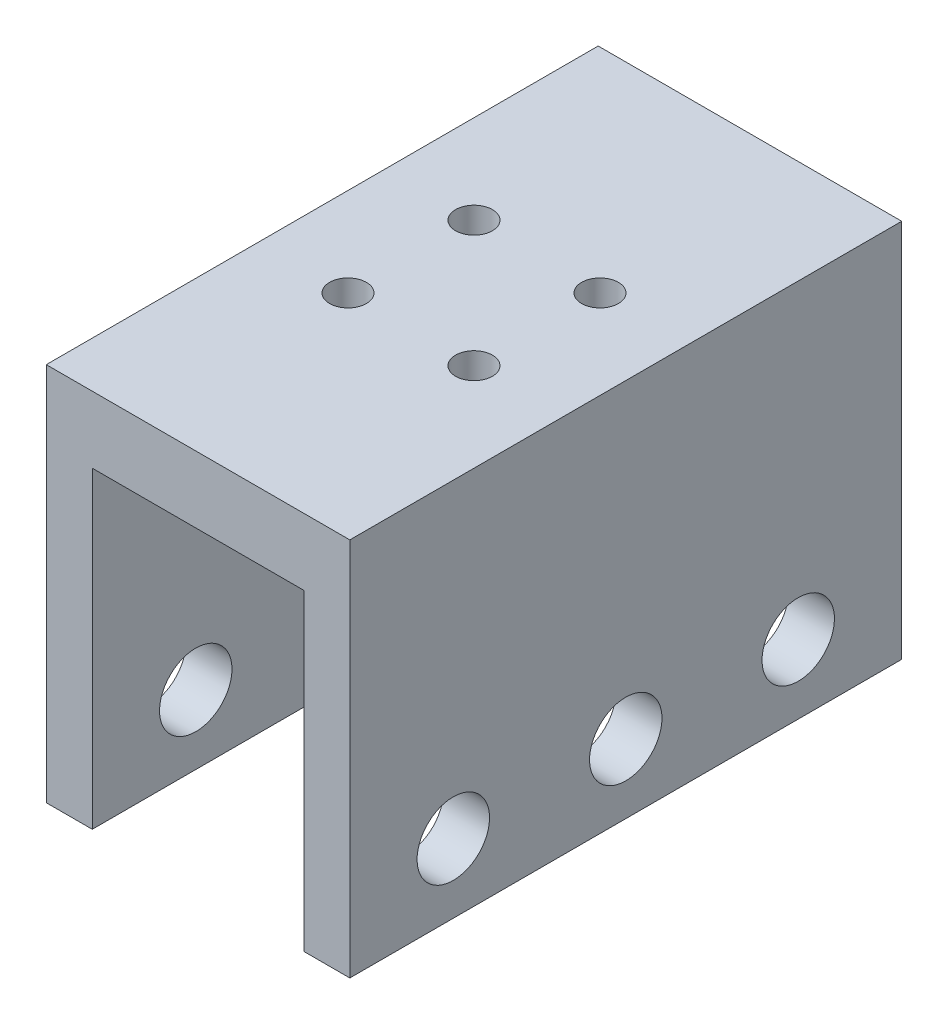
ISO-10303-21;
HEADER;
FILE_DESCRIPTION(('STEP AP214'),'2;1');
FILE_NAME('part.step','',(''),(''),'','','');
FILE_SCHEMA(('AUTOMOTIVE_DESIGN { 1 0 10303 214 1 1 1 1 }'));
ENDSEC;
DATA;
#1=APPLICATION_CONTEXT('core data for automotive mechanical design processes');
#2=APPLICATION_PROTOCOL_DEFINITION('international standard','automotive_design',2000,#1);
#3=PRODUCT_CONTEXT('',#1,'mechanical');
#4=PRODUCT('Part','Part','',(#3));
#5=PRODUCT_RELATED_PRODUCT_CATEGORY('part','',(#4));
#6=PRODUCT_DEFINITION_FORMATION('','',#4);
#7=PRODUCT_DEFINITION_CONTEXT('part definition',#1,'design');
#8=PRODUCT_DEFINITION('design','',#6,#7);
#9=PRODUCT_DEFINITION_SHAPE('','',#8);
#10=(LENGTH_UNIT() NAMED_UNIT(*) SI_UNIT(.MILLI.,.METRE.));
#11=(NAMED_UNIT(*) PLANE_ANGLE_UNIT() SI_UNIT($,.RADIAN.));
#12=(NAMED_UNIT(*) SI_UNIT($,.STERADIAN.) SOLID_ANGLE_UNIT());
#13=UNCERTAINTY_MEASURE_WITH_UNIT(LENGTH_MEASURE(1.E-05),#10,'distance_accuracy_value','');
#14=(GEOMETRIC_REPRESENTATION_CONTEXT(3) GLOBAL_UNCERTAINTY_ASSIGNED_CONTEXT((#13)) GLOBAL_UNIT_ASSIGNED_CONTEXT((#10,
#11,#12)) REPRESENTATION_CONTEXT('',''));
#15=CARTESIAN_POINT('',(0.,0.,0.));
#16=DIRECTION('',(0.,0.,1.));
#17=DIRECTION('',(1.,0.,0.));
#18=AXIS2_PLACEMENT_3D('',#15,#16,#17);
#19=CARTESIAN_POINT('',(4.,0.,24.));
#20=DIRECTION('',(0.,1.,0.));
#21=DIRECTION('',(-1.,0.,0.));
#22=AXIS2_PLACEMENT_3D('',#19,#20,#21);
#23=PLANE('',#22);
#24=DIRECTION('',(1.,0.,0.));
#25=VECTOR('',#24,1.);
#26=CARTESIAN_POINT('',(4.,0.,-24.));
#27=LINE('',#26,#25);
#28=CARTESIAN_POINT('',(0.,0.,-24.));
#29=VERTEX_POINT('',#28);
#30=CARTESIAN_POINT('',(4.,0.,-24.));
#31=VERTEX_POINT('',#30);
#32=EDGE_CURVE('E140',#29,#31,#27,.T.);
#33=ORIENTED_EDGE('',*,*,#32,.T.);
#34=DIRECTION('',(0.,0.,-1.));
#35=VECTOR('',#34,1.);
#36=CARTESIAN_POINT('',(4.,0.,24.));
#37=LINE('',#36,#35);
#38=CARTESIAN_POINT('',(4.,0.,24.));
#39=VERTEX_POINT('',#38);
#40=EDGE_CURVE('E11',#39,#31,#37,.T.);
#41=ORIENTED_EDGE('',*,*,#40,.F.);
#42=DIRECTION('',(1.,0.,0.));
#43=VECTOR('',#42,1.);
#44=CARTESIAN_POINT('',(4.,0.,24.));
#45=LINE('',#44,#43);
#46=CARTESIAN_POINT('',(0.,0.,24.));
#47=VERTEX_POINT('',#46);
#48=EDGE_CURVE('E163',#47,#39,#45,.T.);
#49=ORIENTED_EDGE('',*,*,#48,.F.);
#50=DIRECTION('',(0.,0.,-1.));
#51=VECTOR('',#50,1.);
#52=CARTESIAN_POINT('',(0.,0.,24.));
#53=LINE('',#52,#51);
#54=EDGE_CURVE('E136',#47,#29,#53,.T.);
#55=ORIENTED_EDGE('',*,*,#54,.T.);
#56=EDGE_LOOP('',(#33,#41,#49,#55));
#57=FACE_BOUND('',#56,.T.);
#58=ADVANCED_FACE('F39',(#57),#23,.F.);
#59=CARTESIAN_POINT('',(4.,27.2,24.));
#60=DIRECTION('',(-1.,0.,0.));
#61=DIRECTION('',(0.,-1.,0.));
#62=AXIS2_PLACEMENT_3D('',#59,#60,#61);
#63=PLANE('',#62);
#64=CARTESIAN_POINT('',(4.,6.,15.));
#65=DIRECTION('',(-1.,0.,0.));
#66=DIRECTION('',(0.,-1.,0.));
#67=AXIS2_PLACEMENT_3D('',#64,#65,#66);
#68=CIRCLE('',#67,3.15);
#69=CARTESIAN_POINT('',(4.,2.85,15.));
#70=VERTEX_POINT('',#69);
#71=EDGE_CURVE('E220',#70,#70,#68,.T.);
#72=ORIENTED_EDGE('',*,*,#71,.T.);
#73=EDGE_LOOP('',(#72));
#74=FACE_BOUND('',#73,.T.);
#75=CARTESIAN_POINT('',(4.,6.,-15.));
#76=DIRECTION('',(-1.,0.,0.));
#77=DIRECTION('',(0.,-1.,0.));
#78=AXIS2_PLACEMENT_3D('',#75,#76,#77);
#79=CIRCLE('',#78,3.15);
#80=CARTESIAN_POINT('',(4.,2.85,-15.));
#81=VERTEX_POINT('',#80);
#82=EDGE_CURVE('E246',#81,#81,#79,.T.);
#83=ORIENTED_EDGE('',*,*,#82,.T.);
#84=EDGE_LOOP('',(#83));
#85=FACE_BOUND('',#84,.T.);
#86=CARTESIAN_POINT('',(4.,6.,0.));
#87=DIRECTION('',(-1.,0.,0.));
#88=DIRECTION('',(0.,-1.,0.));
#89=AXIS2_PLACEMENT_3D('',#86,#87,#88);
#90=CIRCLE('',#89,3.15);
#91=CARTESIAN_POINT('',(4.,2.85,0.));
#92=VERTEX_POINT('',#91);
#93=EDGE_CURVE('E254',#92,#92,#90,.T.);
#94=ORIENTED_EDGE('',*,*,#93,.T.);
#95=EDGE_LOOP('',(#94));
#96=FACE_BOUND('',#95,.T.);
#97=DIRECTION('',(0.,1.,0.));
#98=VECTOR('',#97,1.);
#99=CARTESIAN_POINT('',(4.,27.2,-24.));
#100=LINE('',#99,#98);
#101=CARTESIAN_POINT('',(4.,27.2,-24.));
#102=VERTEX_POINT('',#101);
#103=EDGE_CURVE('E144',#31,#102,#100,.T.);
#104=ORIENTED_EDGE('',*,*,#103,.T.);
#105=DIRECTION('',(0.,0.,-1.));
#106=VECTOR('',#105,1.);
#107=CARTESIAN_POINT('',(4.,27.2,24.));
#108=LINE('',#107,#106);
#109=CARTESIAN_POINT('',(4.,27.2,24.));
#110=VERTEX_POINT('',#109);
#111=EDGE_CURVE('E48',#110,#102,#108,.T.);
#112=ORIENTED_EDGE('',*,*,#111,.F.);
#113=DIRECTION('',(0.,1.,0.));
#114=VECTOR('',#113,1.);
#115=CARTESIAN_POINT('',(4.,27.2,24.));
#116=LINE('',#115,#114);
#117=EDGE_CURVE('E99',#39,#110,#116,.T.);
#118=ORIENTED_EDGE('',*,*,#117,.F.);
#119=ORIENTED_EDGE('',*,*,#40,.T.);
#120=EDGE_LOOP('',(#104,#112,#118,#119));
#121=FACE_BOUND('',#120,.T.);
#122=ADVANCED_FACE('F312',(#74,#85,#96,#121),#63,.F.);
#123=CARTESIAN_POINT('',(22.4,27.2,24.));
#124=DIRECTION('',(0.,1.,0.));
#125=DIRECTION('',(-1.,0.,0.));
#126=AXIS2_PLACEMENT_3D('',#123,#124,#125);
#127=PLANE('',#126);
#128=CARTESIAN_POINT('',(7.71992244580426,27.2,-5.48007755419574));
#129=DIRECTION('',(0.,-1.,0.));
#130=DIRECTION('',(1.,0.,0.));
#131=AXIS2_PLACEMENT_3D('',#128,#129,#130);
#132=CIRCLE('',#131,1.6);
#133=CARTESIAN_POINT('',(9.31992244580426,27.2,-5.48007755419574));
#134=VERTEX_POINT('',#133);
#135=EDGE_CURVE('E215',#134,#134,#132,.T.);
#136=ORIENTED_EDGE('',*,*,#135,.F.);
#137=EDGE_LOOP('',(#136));
#138=FACE_BOUND('',#137,.T.);
#139=CARTESIAN_POINT('',(18.6800775541957,27.2,-5.48007755419574));
#140=DIRECTION('',(0.,-1.,0.));
#141=DIRECTION('',(1.,0.,0.));
#142=AXIS2_PLACEMENT_3D('',#139,#140,#141);
#143=CIRCLE('',#142,1.60000000000001);
#144=CARTESIAN_POINT('',(20.2800775541958,27.2,-5.48007755419574));
#145=VERTEX_POINT('',#144);
#146=EDGE_CURVE('E224',#145,#145,#143,.T.);
#147=ORIENTED_EDGE('',*,*,#146,.F.);
#148=EDGE_LOOP('',(#147));
#149=FACE_BOUND('',#148,.T.);
#150=CARTESIAN_POINT('',(18.6800775541957,27.2,5.48007755419574));
#151=DIRECTION('',(0.,-1.,0.));
#152=DIRECTION('',(1.,0.,0.));
#153=AXIS2_PLACEMENT_3D('',#150,#151,#152);
#154=CIRCLE('',#153,1.60000000000001);
#155=CARTESIAN_POINT('',(20.2800775541958,27.2,5.48007755419574));
#156=VERTEX_POINT('',#155);
#157=EDGE_CURVE('E232',#156,#156,#154,.T.);
#158=ORIENTED_EDGE('',*,*,#157,.F.);
#159=EDGE_LOOP('',(#158));
#160=FACE_BOUND('',#159,.T.);
#161=CARTESIAN_POINT('',(7.71992244580426,27.2,5.48007755419574));
#162=DIRECTION('',(0.,-1.,0.));
#163=DIRECTION('',(1.,0.,0.));
#164=AXIS2_PLACEMENT_3D('',#161,#162,#163);
#165=CIRCLE('',#164,1.6);
#166=CARTESIAN_POINT('',(9.31992244580426,27.2,5.48007755419574));
#167=VERTEX_POINT('',#166);
#168=EDGE_CURVE('E207',#167,#167,#165,.T.);
#169=ORIENTED_EDGE('',*,*,#168,.F.);
#170=EDGE_LOOP('',(#169));
#171=FACE_BOUND('',#170,.T.);
#172=DIRECTION('',(1.,0.,0.));
#173=VECTOR('',#172,1.);
#174=CARTESIAN_POINT('',(22.4,27.2,-24.));
#175=LINE('',#174,#173);
#176=CARTESIAN_POINT('',(22.4,27.2,-24.));
#177=VERTEX_POINT('',#176);
#178=EDGE_CURVE('E148',#102,#177,#175,.T.);
#179=ORIENTED_EDGE('',*,*,#178,.T.);
#180=DIRECTION('',(0.,0.,-1.));
#181=VECTOR('',#180,1.);
#182=CARTESIAN_POINT('',(22.4,27.2,24.));
#183=LINE('',#182,#181);
#184=CARTESIAN_POINT('',(22.4,27.2,24.));
#185=VERTEX_POINT('',#184);
#186=EDGE_CURVE('E174',#185,#177,#183,.T.);
#187=ORIENTED_EDGE('',*,*,#186,.F.);
#188=DIRECTION('',(1.,0.,0.));
#189=VECTOR('',#188,1.);
#190=CARTESIAN_POINT('',(22.4,27.2,24.));
#191=LINE('',#190,#189);
#192=EDGE_CURVE('E184',#110,#185,#191,.T.);
#193=ORIENTED_EDGE('',*,*,#192,.F.);
#194=ORIENTED_EDGE('',*,*,#111,.T.);
#195=EDGE_LOOP('',(#179,#187,#193,#194));
#196=FACE_BOUND('',#195,.T.);
#197=ADVANCED_FACE('F182',(#138,#149,#160,#171,#196),#127,.F.);
#198=CARTESIAN_POINT('',(22.4,0.,24.));
#199=DIRECTION('',(1.,0.,0.));
#200=DIRECTION('',(0.,1.,0.));
#201=AXIS2_PLACEMENT_3D('',#198,#199,#200);
#202=PLANE('',#201);
#203=CARTESIAN_POINT('',(22.4,6.,15.));
#204=DIRECTION('',(1.,0.,0.));
#205=DIRECTION('',(0.,1.,0.));
#206=AXIS2_PLACEMENT_3D('',#203,#204,#205);
#207=CIRCLE('',#206,3.15);
#208=CARTESIAN_POINT('',(22.4,9.15,15.));
#209=VERTEX_POINT('',#208);
#210=EDGE_CURVE('E242',#209,#209,#207,.T.);
#211=ORIENTED_EDGE('',*,*,#210,.T.);
#212=EDGE_LOOP('',(#211));
#213=FACE_BOUND('',#212,.T.);
#214=CARTESIAN_POINT('',(22.4,6.,-15.));
#215=DIRECTION('',(1.,0.,0.));
#216=DIRECTION('',(0.,1.,0.));
#217=AXIS2_PLACEMENT_3D('',#214,#215,#216);
#218=CIRCLE('',#217,3.15);
#219=CARTESIAN_POINT('',(22.4,9.15,-15.));
#220=VERTEX_POINT('',#219);
#221=EDGE_CURVE('E250',#220,#220,#218,.T.);
#222=ORIENTED_EDGE('',*,*,#221,.T.);
#223=EDGE_LOOP('',(#222));
#224=FACE_BOUND('',#223,.T.);
#225=CARTESIAN_POINT('',(22.4,6.,0.));
#226=DIRECTION('',(1.,0.,0.));
#227=DIRECTION('',(0.,1.,0.));
#228=AXIS2_PLACEMENT_3D('',#225,#226,#227);
#229=CIRCLE('',#228,3.15);
#230=CARTESIAN_POINT('',(22.4,9.15,0.));
#231=VERTEX_POINT('',#230);
#232=EDGE_CURVE('E258',#231,#231,#229,.T.);
#233=ORIENTED_EDGE('',*,*,#232,.T.);
#234=EDGE_LOOP('',(#233));
#235=FACE_BOUND('',#234,.T.);
#236=DIRECTION('',(0.,-1.,0.));
#237=VECTOR('',#236,1.);
#238=CARTESIAN_POINT('',(22.4,0.,-24.));
#239=LINE('',#238,#237);
#240=CARTESIAN_POINT('',(22.4,0.,-24.));
#241=VERTEX_POINT('',#240);
#242=EDGE_CURVE('E151',#177,#241,#239,.T.);
#243=ORIENTED_EDGE('',*,*,#242,.T.);
#244=DIRECTION('',(0.,0.,-1.));
#245=VECTOR('',#244,1.);
#246=CARTESIAN_POINT('',(22.4,0.,24.));
#247=LINE('',#246,#245);
#248=CARTESIAN_POINT('',(22.4,0.,24.));
#249=VERTEX_POINT('',#248);
#250=EDGE_CURVE('E170',#249,#241,#247,.T.);
#251=ORIENTED_EDGE('',*,*,#250,.F.);
#252=DIRECTION('',(0.,-1.,0.));
#253=VECTOR('',#252,1.);
#254=CARTESIAN_POINT('',(22.4,0.,24.));
#255=LINE('',#254,#253);
#256=EDGE_CURVE('E197',#185,#249,#255,.T.);
#257=ORIENTED_EDGE('',*,*,#256,.F.);
#258=ORIENTED_EDGE('',*,*,#186,.T.);
#259=EDGE_LOOP('',(#243,#251,#257,#258));
#260=FACE_BOUND('',#259,.T.);
#261=ADVANCED_FACE('F192',(#213,#224,#235,#260),#202,.F.);
#262=CARTESIAN_POINT('',(26.4,0.,24.));
#263=DIRECTION('',(0.,1.,0.));
#264=DIRECTION('',(-1.,0.,0.));
#265=AXIS2_PLACEMENT_3D('',#262,#263,#264);
#266=PLANE('',#265);
#267=DIRECTION('',(1.,0.,0.));
#268=VECTOR('',#267,1.);
#269=CARTESIAN_POINT('',(26.4,0.,-24.));
#270=LINE('',#269,#268);
#271=CARTESIAN_POINT('',(26.4,0.,-24.));
#272=VERTEX_POINT('',#271);
#273=EDGE_CURVE('E154',#241,#272,#270,.T.);
#274=ORIENTED_EDGE('',*,*,#273,.T.);
#275=DIRECTION('',(0.,0.,-1.));
#276=VECTOR('',#275,1.);
#277=CARTESIAN_POINT('',(26.4,0.,24.));
#278=LINE('',#277,#276);
#279=CARTESIAN_POINT('',(26.4,0.,24.));
#280=VERTEX_POINT('',#279);
#281=EDGE_CURVE('E129',#280,#272,#278,.T.);
#282=ORIENTED_EDGE('',*,*,#281,.F.);
#283=DIRECTION('',(1.,0.,0.));
#284=VECTOR('',#283,1.);
#285=CARTESIAN_POINT('',(26.4,0.,24.));
#286=LINE('',#285,#284);
#287=EDGE_CURVE('E118',#249,#280,#286,.T.);
#288=ORIENTED_EDGE('',*,*,#287,.F.);
#289=ORIENTED_EDGE('',*,*,#250,.T.);
#290=EDGE_LOOP('',(#274,#282,#288,#289));
#291=FACE_BOUND('',#290,.T.);
#292=ADVANCED_FACE('F195',(#291),#266,.F.);
#293=CARTESIAN_POINT('',(26.4,33.,24.));
#294=DIRECTION('',(-1.,0.,0.));
#295=DIRECTION('',(0.,-1.,0.));
#296=AXIS2_PLACEMENT_3D('',#293,#294,#295);
#297=PLANE('',#296);
#298=CARTESIAN_POINT('',(26.4,6.,15.));
#299=DIRECTION('',(1.,0.,0.));
#300=DIRECTION('',(0.,1.,0.));
#301=AXIS2_PLACEMENT_3D('',#298,#299,#300);
#302=CIRCLE('',#301,3.15);
#303=CARTESIAN_POINT('',(26.4,9.15,15.));
#304=VERTEX_POINT('',#303);
#305=EDGE_CURVE('E276',#304,#304,#302,.T.);
#306=ORIENTED_EDGE('',*,*,#305,.F.);
#307=EDGE_LOOP('',(#306));
#308=FACE_BOUND('',#307,.T.);
#309=CARTESIAN_POINT('',(26.4,6.,-15.));
#310=DIRECTION('',(1.,0.,0.));
#311=DIRECTION('',(0.,1.,0.));
#312=AXIS2_PLACEMENT_3D('',#309,#310,#311);
#313=CIRCLE('',#312,3.15);
#314=CARTESIAN_POINT('',(26.4,9.15,-15.));
#315=VERTEX_POINT('',#314);
#316=EDGE_CURVE('E275',#315,#315,#313,.T.);
#317=ORIENTED_EDGE('',*,*,#316,.F.);
#318=EDGE_LOOP('',(#317));
#319=FACE_BOUND('',#318,.T.);
#320=CARTESIAN_POINT('',(26.4,6.,0.));
#321=DIRECTION('',(1.,0.,0.));
#322=DIRECTION('',(0.,1.,0.));
#323=AXIS2_PLACEMENT_3D('',#320,#321,#322);
#324=CIRCLE('',#323,3.15);
#325=CARTESIAN_POINT('',(26.4,9.15,0.));
#326=VERTEX_POINT('',#325);
#327=EDGE_CURVE('E266',#326,#326,#324,.T.);
#328=ORIENTED_EDGE('',*,*,#327,.F.);
#329=EDGE_LOOP('',(#328));
#330=FACE_BOUND('',#329,.T.);
#331=DIRECTION('',(0.,1.,0.));
#332=VECTOR('',#331,1.);
#333=CARTESIAN_POINT('',(26.4,33.,-24.));
#334=LINE('',#333,#332);
#335=CARTESIAN_POINT('',(26.4,33.,-24.));
#336=VERTEX_POINT('',#335);
#337=EDGE_CURVE('E127',#272,#336,#334,.T.);
#338=ORIENTED_EDGE('',*,*,#337,.T.);
#339=DIRECTION('',(0.,0.,-1.));
#340=VECTOR('',#339,1.);
#341=CARTESIAN_POINT('',(26.4,33.,24.));
#342=LINE('',#341,#340);
#343=CARTESIAN_POINT('',(26.4,33.,24.));
#344=VERTEX_POINT('',#343);
#345=EDGE_CURVE('E124',#344,#336,#342,.T.);
#346=ORIENTED_EDGE('',*,*,#345,.F.);
#347=DIRECTION('',(0.,1.,0.));
#348=VECTOR('',#347,1.);
#349=CARTESIAN_POINT('',(26.4,33.,24.));
#350=LINE('',#349,#348);
#351=EDGE_CURVE('E112',#280,#344,#350,.T.);
#352=ORIENTED_EDGE('',*,*,#351,.F.);
#353=ORIENTED_EDGE('',*,*,#281,.T.);
#354=EDGE_LOOP('',(#338,#346,#352,#353));
#355=FACE_BOUND('',#354,.T.);
#356=ADVANCED_FACE('F125',(#308,#319,#330,#355),#297,.F.);
#357=CARTESIAN_POINT('',(0.,33.,24.));
#358=DIRECTION('',(0.,-1.,0.));
#359=DIRECTION('',(0.,0.,-1.));
#360=AXIS2_PLACEMENT_3D('',#357,#358,#359);
#361=PLANE('',#360);
#362=CARTESIAN_POINT('',(7.71992244580426,33.,-5.48007755419574));
#363=DIRECTION('',(0.,-1.,0.));
#364=DIRECTION('',(1.,0.,0.));
#365=AXIS2_PLACEMENT_3D('',#362,#363,#364);
#366=CIRCLE('',#365,1.6);
#367=CARTESIAN_POINT('',(9.31992244580426,33.,-5.48007755419574));
#368=VERTEX_POINT('',#367);
#369=EDGE_CURVE('E219',#368,#368,#366,.T.);
#370=ORIENTED_EDGE('',*,*,#369,.T.);
#371=EDGE_LOOP('',(#370));
#372=FACE_BOUND('',#371,.T.);
#373=CARTESIAN_POINT('',(18.6800775541957,33.,-5.48007755419574));
#374=DIRECTION('',(0.,-1.,0.));
#375=DIRECTION('',(1.,0.,0.));
#376=AXIS2_PLACEMENT_3D('',#373,#374,#375);
#377=CIRCLE('',#376,1.60000000000001);
#378=CARTESIAN_POINT('',(20.2800775541958,33.,-5.48007755419574));
#379=VERTEX_POINT('',#378);
#380=EDGE_CURVE('E228',#379,#379,#377,.T.);
#381=ORIENTED_EDGE('',*,*,#380,.T.);
#382=EDGE_LOOP('',(#381));
#383=FACE_BOUND('',#382,.T.);
#384=CARTESIAN_POINT('',(18.6800775541957,33.,5.48007755419574));
#385=DIRECTION('',(0.,-1.,0.));
#386=DIRECTION('',(1.,0.,0.));
#387=AXIS2_PLACEMENT_3D('',#384,#385,#386);
#388=CIRCLE('',#387,1.60000000000001);
#389=CARTESIAN_POINT('',(20.2800775541958,33.,5.48007755419574));
#390=VERTEX_POINT('',#389);
#391=EDGE_CURVE('E211',#390,#390,#388,.T.);
#392=ORIENTED_EDGE('',*,*,#391,.T.);
#393=EDGE_LOOP('',(#392));
#394=FACE_BOUND('',#393,.T.);
#395=CARTESIAN_POINT('',(7.71992244580426,33.,5.48007755419574));
#396=DIRECTION('',(0.,-1.,0.));
#397=DIRECTION('',(1.,0.,0.));
#398=AXIS2_PLACEMENT_3D('',#395,#396,#397);
#399=CIRCLE('',#398,1.6);
#400=CARTESIAN_POINT('',(9.31992244580426,33.,5.48007755419574));
#401=VERTEX_POINT('',#400);
#402=EDGE_CURVE('E145',#401,#401,#399,.T.);
#403=ORIENTED_EDGE('',*,*,#402,.T.);
#404=EDGE_LOOP('',(#403));
#405=FACE_BOUND('',#404,.T.);
#406=DIRECTION('',(-1.,0.,0.));
#407=VECTOR('',#406,1.);
#408=CARTESIAN_POINT('',(0.,33.,-24.));
#409=LINE('',#408,#407);
#410=CARTESIAN_POINT('',(0.,33.,-24.));
#411=VERTEX_POINT('',#410);
#412=EDGE_CURVE('E85',#336,#411,#409,.T.);
#413=ORIENTED_EDGE('',*,*,#412,.T.);
#414=DIRECTION('',(0.,0.,-1.));
#415=VECTOR('',#414,1.);
#416=CARTESIAN_POINT('',(0.,33.,24.));
#417=LINE('',#416,#415);
#418=CARTESIAN_POINT('',(0.,33.,24.));
#419=VERTEX_POINT('',#418);
#420=EDGE_CURVE('E130',#419,#411,#417,.T.);
#421=ORIENTED_EDGE('',*,*,#420,.F.);
#422=DIRECTION('',(-1.,0.,0.));
#423=VECTOR('',#422,1.);
#424=CARTESIAN_POINT('',(0.,33.,24.));
#425=LINE('',#424,#423);
#426=EDGE_CURVE('E116',#344,#419,#425,.T.);
#427=ORIENTED_EDGE('',*,*,#426,.F.);
#428=ORIENTED_EDGE('',*,*,#345,.T.);
#429=EDGE_LOOP('',(#413,#421,#427,#428));
#430=FACE_BOUND('',#429,.T.);
#431=ADVANCED_FACE('F132',(#372,#383,#394,#405,#430),#361,.F.);
#432=CARTESIAN_POINT('',(0.,0.,24.));
#433=DIRECTION('',(1.,0.,0.));
#434=DIRECTION('',(0.,0.,-1.));
#435=AXIS2_PLACEMENT_3D('',#432,#433,#434);
#436=PLANE('',#435);
#437=CARTESIAN_POINT('',(0.,6.,15.));
#438=DIRECTION('',(1.,0.,0.));
#439=DIRECTION('',(0.,0.,-1.));
#440=AXIS2_PLACEMENT_3D('',#437,#438,#439);
#441=CIRCLE('',#440,3.15);
#442=CARTESIAN_POINT('',(0.,6.,11.85));
#443=VERTEX_POINT('',#442);
#444=EDGE_CURVE('E271',#443,#443,#441,.F.);
#445=ORIENTED_EDGE('',*,*,#444,.F.);
#446=EDGE_LOOP('',(#445));
#447=FACE_BOUND('',#446,.T.);
#448=CARTESIAN_POINT('',(0.,6.,-15.));
#449=DIRECTION('',(1.,0.,0.));
#450=DIRECTION('',(0.,0.,-1.));
#451=AXIS2_PLACEMENT_3D('',#448,#449,#450);
#452=CIRCLE('',#451,3.15);
#453=CARTESIAN_POINT('',(0.,6.,-18.15));
#454=VERTEX_POINT('',#453);
#455=EDGE_CURVE('E270',#454,#454,#452,.F.);
#456=ORIENTED_EDGE('',*,*,#455,.F.);
#457=EDGE_LOOP('',(#456));
#458=FACE_BOUND('',#457,.T.);
#459=CARTESIAN_POINT('',(0.,6.,0.));
#460=DIRECTION('',(1.,0.,0.));
#461=DIRECTION('',(0.,0.,-1.));
#462=AXIS2_PLACEMENT_3D('',#459,#460,#461);
#463=CIRCLE('',#462,3.15);
#464=CARTESIAN_POINT('',(0.,6.,-3.15));
#465=VERTEX_POINT('',#464);
#466=EDGE_CURVE('E262',#465,#465,#463,.F.);
#467=ORIENTED_EDGE('',*,*,#466,.F.);
#468=EDGE_LOOP('',(#467));
#469=FACE_BOUND('',#468,.T.);
#470=DIRECTION('',(0.,-1.,0.));
#471=VECTOR('',#470,1.);
#472=CARTESIAN_POINT('',(0.,0.,-24.));
#473=LINE('',#472,#471);
#474=EDGE_CURVE('E91',#411,#29,#473,.T.);
#475=ORIENTED_EDGE('',*,*,#474,.T.);
#476=ORIENTED_EDGE('',*,*,#54,.F.);
#477=DIRECTION('',(0.,-1.,0.));
#478=VECTOR('',#477,1.);
#479=CARTESIAN_POINT('',(0.,0.,24.));
#480=LINE('',#479,#478);
#481=EDGE_CURVE('E56',#419,#47,#480,.T.);
#482=ORIENTED_EDGE('',*,*,#481,.F.);
#483=ORIENTED_EDGE('',*,*,#420,.T.);
#484=EDGE_LOOP('',(#475,#476,#482,#483));
#485=FACE_BOUND('',#484,.T.);
#486=ADVANCED_FACE('F324',(#447,#458,#469,#485),#436,.F.);
#487=CARTESIAN_POINT('',(0.,0.,24.));
#488=DIRECTION('',(0.,0.,-1.));
#489=DIRECTION('',(-1.,0.,0.));
#490=AXIS2_PLACEMENT_3D('',#487,#488,#489);
#491=PLANE('',#490);
#492=ORIENTED_EDGE('',*,*,#48,.T.);
#493=ORIENTED_EDGE('',*,*,#117,.T.);
#494=ORIENTED_EDGE('',*,*,#192,.T.);
#495=ORIENTED_EDGE('',*,*,#256,.T.);
#496=ORIENTED_EDGE('',*,*,#287,.T.);
#497=ORIENTED_EDGE('',*,*,#351,.T.);
#498=ORIENTED_EDGE('',*,*,#426,.T.);
#499=ORIENTED_EDGE('',*,*,#481,.T.);
#500=EDGE_LOOP('',(#492,#493,#494,#495,#496,#497,#498,#499));
#501=FACE_BOUND('',#500,.T.);
#502=ADVANCED_FACE('F114',(#501),#491,.F.);
#503=CARTESIAN_POINT('',(0.,0.,-24.));
#504=DIRECTION('',(0.,0.,-1.));
#505=DIRECTION('',(-1.,0.,0.));
#506=AXIS2_PLACEMENT_3D('',#503,#504,#505);
#507=PLANE('',#506);
#508=ORIENTED_EDGE('',*,*,#32,.F.);
#509=ORIENTED_EDGE('',*,*,#474,.F.);
#510=ORIENTED_EDGE('',*,*,#412,.F.);
#511=ORIENTED_EDGE('',*,*,#337,.F.);
#512=ORIENTED_EDGE('',*,*,#273,.F.);
#513=ORIENTED_EDGE('',*,*,#242,.F.);
#514=ORIENTED_EDGE('',*,*,#178,.F.);
#515=ORIENTED_EDGE('',*,*,#103,.F.);
#516=EDGE_LOOP('',(#508,#509,#510,#511,#512,#513,#514,#515));
#517=FACE_BOUND('',#516,.T.);
#518=ADVANCED_FACE('F188',(#517),#507,.T.);
#519=CARTESIAN_POINT('',(7.71992244580426,33.,5.48007755419574));
#520=DIRECTION('',(0.,-1.,0.));
#521=DIRECTION('',(1.,0.,0.));
#522=AXIS2_PLACEMENT_3D('',#519,#520,#521);
#523=CYLINDRICAL_SURFACE('',#522,1.6);
#524=ORIENTED_EDGE('',*,*,#402,.F.);
#525=EDGE_LOOP('',(#524));
#526=FACE_BOUND('',#525,.T.);
#527=ORIENTED_EDGE('',*,*,#168,.T.);
#528=EDGE_LOOP('',(#527));
#529=FACE_BOUND('',#528,.T.);
#530=ADVANCED_FACE('F339',(#526,#529),#523,.F.);
#531=CARTESIAN_POINT('',(18.6800775541957,33.,5.48007755419574));
#532=DIRECTION('',(0.,-1.,0.));
#533=DIRECTION('',(1.,0.,0.));
#534=AXIS2_PLACEMENT_3D('',#531,#532,#533);
#535=CYLINDRICAL_SURFACE('',#534,1.60000000000001);
#536=ORIENTED_EDGE('',*,*,#391,.F.);
#537=EDGE_LOOP('',(#536));
#538=FACE_BOUND('',#537,.T.);
#539=ORIENTED_EDGE('',*,*,#157,.T.);
#540=EDGE_LOOP('',(#539));
#541=FACE_BOUND('',#540,.T.);
#542=ADVANCED_FACE('F343',(#538,#541),#535,.F.);
#543=CARTESIAN_POINT('',(18.6800775541957,33.,-5.48007755419574));
#544=DIRECTION('',(0.,-1.,0.));
#545=DIRECTION('',(1.,0.,0.));
#546=AXIS2_PLACEMENT_3D('',#543,#544,#545);
#547=CYLINDRICAL_SURFACE('',#546,1.60000000000001);
#548=ORIENTED_EDGE('',*,*,#380,.F.);
#549=EDGE_LOOP('',(#548));
#550=FACE_BOUND('',#549,.T.);
#551=ORIENTED_EDGE('',*,*,#146,.T.);
#552=EDGE_LOOP('',(#551));
#553=FACE_BOUND('',#552,.T.);
#554=ADVANCED_FACE('F348',(#550,#553),#547,.F.);
#555=CARTESIAN_POINT('',(7.71992244580426,33.,-5.48007755419574));
#556=DIRECTION('',(0.,-1.,0.));
#557=DIRECTION('',(1.,0.,0.));
#558=AXIS2_PLACEMENT_3D('',#555,#556,#557);
#559=CYLINDRICAL_SURFACE('',#558,1.6);
#560=ORIENTED_EDGE('',*,*,#369,.F.);
#561=EDGE_LOOP('',(#560));
#562=FACE_BOUND('',#561,.T.);
#563=ORIENTED_EDGE('',*,*,#135,.T.);
#564=EDGE_LOOP('',(#563));
#565=FACE_BOUND('',#564,.T.);
#566=ADVANCED_FACE('F345',(#562,#565),#559,.F.);
#567=CARTESIAN_POINT('',(-8.9095454429505,6.,0.));
#568=DIRECTION('',(1.,0.,0.));
#569=DIRECTION('',(0.,1.,0.));
#570=AXIS2_PLACEMENT_3D('',#567,#568,#569);
#571=CYLINDRICAL_SURFACE('',#570,3.15);
#572=ORIENTED_EDGE('',*,*,#466,.T.);
#573=EDGE_LOOP('',(#572));
#574=FACE_BOUND('',#573,.T.);
#575=ORIENTED_EDGE('',*,*,#93,.F.);
#576=EDGE_LOOP('',(#575));
#577=FACE_BOUND('',#576,.T.);
#578=ADVANCED_FACE('F301',(#574,#577),#571,.F.);
#579=CARTESIAN_POINT('',(-8.9095454429505,6.,-15.));
#580=DIRECTION('',(1.,0.,0.));
#581=DIRECTION('',(0.,1.,0.));
#582=AXIS2_PLACEMENT_3D('',#579,#580,#581);
#583=CYLINDRICAL_SURFACE('',#582,3.15);
#584=ORIENTED_EDGE('',*,*,#455,.T.);
#585=EDGE_LOOP('',(#584));
#586=FACE_BOUND('',#585,.T.);
#587=ORIENTED_EDGE('',*,*,#82,.F.);
#588=EDGE_LOOP('',(#587));
#589=FACE_BOUND('',#588,.T.);
#590=ADVANCED_FACE('F357',(#586,#589),#583,.F.);
#591=CARTESIAN_POINT('',(-8.9095454429505,6.,15.));
#592=DIRECTION('',(1.,0.,0.));
#593=DIRECTION('',(0.,1.,0.));
#594=AXIS2_PLACEMENT_3D('',#591,#592,#593);
#595=CYLINDRICAL_SURFACE('',#594,3.15);
#596=ORIENTED_EDGE('',*,*,#444,.T.);
#597=EDGE_LOOP('',(#596));
#598=FACE_BOUND('',#597,.T.);
#599=ORIENTED_EDGE('',*,*,#71,.F.);
#600=EDGE_LOOP('',(#599));
#601=FACE_BOUND('',#600,.T.);
#602=ADVANCED_FACE('F299',(#598,#601),#595,.F.);
#603=ORIENTED_EDGE('',*,*,#327,.T.);
#604=EDGE_LOOP('',(#603));
#605=FACE_BOUND('',#604,.T.);
#606=ORIENTED_EDGE('',*,*,#232,.F.);
#607=EDGE_LOOP('',(#606));
#608=FACE_BOUND('',#607,.T.);
#609=ADVANCED_FACE('F296',(#605,#608),#571,.F.);
#610=ORIENTED_EDGE('',*,*,#316,.T.);
#611=EDGE_LOOP('',(#610));
#612=FACE_BOUND('',#611,.T.);
#613=ORIENTED_EDGE('',*,*,#221,.F.);
#614=EDGE_LOOP('',(#613));
#615=FACE_BOUND('',#614,.T.);
#616=ADVANCED_FACE('F287',(#612,#615),#583,.F.);
#617=ORIENTED_EDGE('',*,*,#305,.T.);
#618=EDGE_LOOP('',(#617));
#619=FACE_BOUND('',#618,.T.);
#620=ORIENTED_EDGE('',*,*,#210,.F.);
#621=EDGE_LOOP('',(#620));
#622=FACE_BOUND('',#621,.T.);
#623=ADVANCED_FACE('F362',(#619,#622),#595,.F.);
#624=CLOSED_SHELL('',(#58,#122,#197,#261,#292,#356,#431,#486,#502,#518,#530,#542,#554,#566,#578,
#590,#602,#609,#616,#623));
#625=MANIFOLD_SOLID_BREP('B2',#624);
#626=ADVANCED_BREP_SHAPE_REPRESENTATION('',(#18,#625),#14);
#627=SHAPE_DEFINITION_REPRESENTATION(#9,#626);
ENDSEC;
END-ISO-10303-21;
